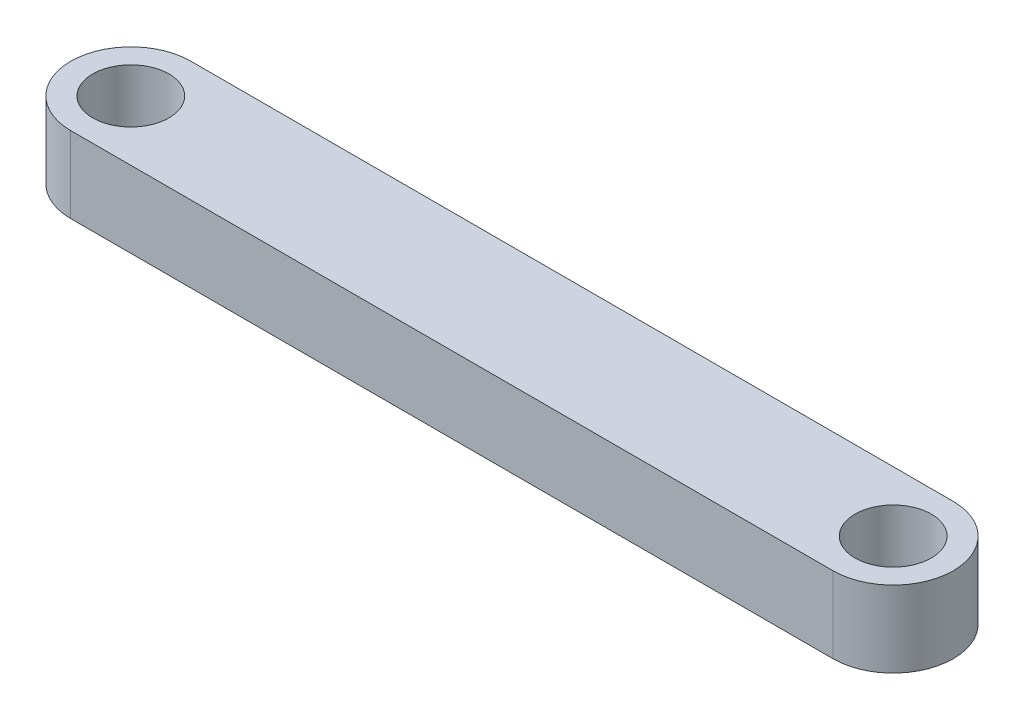
ISO-10303-21;
HEADER;
FILE_DESCRIPTION(('STEP AP214'),'2;1');
FILE_NAME('part.step','',(''),(''),'','','');
FILE_SCHEMA(('AUTOMOTIVE_DESIGN { 1 0 10303 214 1 1 1 1 }'));
ENDSEC;
DATA;
#1=APPLICATION_CONTEXT('core data for automotive mechanical design processes');
#2=APPLICATION_PROTOCOL_DEFINITION('international standard','automotive_design',2000,#1);
#3=PRODUCT_CONTEXT('',#1,'mechanical');
#4=PRODUCT('Part','Part','',(#3));
#5=PRODUCT_RELATED_PRODUCT_CATEGORY('part','',(#4));
#6=PRODUCT_DEFINITION_FORMATION('','',#4);
#7=PRODUCT_DEFINITION_CONTEXT('part definition',#1,'design');
#8=PRODUCT_DEFINITION('design','',#6,#7);
#9=PRODUCT_DEFINITION_SHAPE('','',#8);
#10=(LENGTH_UNIT() NAMED_UNIT(*) SI_UNIT(.MILLI.,.METRE.));
#11=(NAMED_UNIT(*) PLANE_ANGLE_UNIT() SI_UNIT($,.RADIAN.));
#12=(NAMED_UNIT(*) SI_UNIT($,.STERADIAN.) SOLID_ANGLE_UNIT());
#13=UNCERTAINTY_MEASURE_WITH_UNIT(LENGTH_MEASURE(1.E-05),#10,'distance_accuracy_value','');
#14=(GEOMETRIC_REPRESENTATION_CONTEXT(3) GLOBAL_UNCERTAINTY_ASSIGNED_CONTEXT((#13)) GLOBAL_UNIT_ASSIGNED_CONTEXT((#10,
#11,#12)) REPRESENTATION_CONTEXT('',''));
#15=CARTESIAN_POINT('',(0.,0.,0.));
#16=DIRECTION('',(0.,0.,1.));
#17=DIRECTION('',(1.,0.,0.));
#18=AXIS2_PLACEMENT_3D('',#15,#16,#17);
#19=CARTESIAN_POINT('',(15.,3.,0.));
#20=DIRECTION('',(0.,-1.,0.));
#21=DIRECTION('',(0.,0.,-1.));
#22=AXIS2_PLACEMENT_3D('',#19,#20,#21);
#23=CYLINDRICAL_SURFACE('',#22,2.36500190672861);
#24=CARTESIAN_POINT('',(15.,0.,0.));
#25=DIRECTION('',(0.,1.,0.));
#26=DIRECTION('',(0.,0.,1.));
#27=AXIS2_PLACEMENT_3D('',#24,#25,#26);
#28=CIRCLE('',#27,2.36500190672861);
#29=CARTESIAN_POINT('',(15.,0.,-2.36500190672861));
#30=VERTEX_POINT('',#29);
#31=CARTESIAN_POINT('',(15.,0.,2.36500190672861));
#32=VERTEX_POINT('',#31);
#33=EDGE_CURVE('E106',#30,#32,#28,.F.);
#34=ORIENTED_EDGE('',*,*,#33,.F.);
#35=DIRECTION('',(0.,-1.,0.));
#36=VECTOR('',#35,1.);
#37=CARTESIAN_POINT('',(15.,3.,-2.36500190672861));
#38=LINE('',#37,#36);
#39=CARTESIAN_POINT('',(15.,3.,-2.36500190672861));
#40=VERTEX_POINT('',#39);
#41=EDGE_CURVE('E11',#40,#30,#38,.T.);
#42=ORIENTED_EDGE('',*,*,#41,.F.);
#43=CARTESIAN_POINT('',(15.,3.,0.));
#44=DIRECTION('',(0.,1.,0.));
#45=DIRECTION('',(0.,0.,1.));
#46=AXIS2_PLACEMENT_3D('',#43,#44,#45);
#47=CIRCLE('',#46,2.36500190672861);
#48=CARTESIAN_POINT('',(15.,3.,2.36500190672861));
#49=VERTEX_POINT('',#48);
#50=EDGE_CURVE('E94',#40,#49,#47,.F.);
#51=ORIENTED_EDGE('',*,*,#50,.T.);
#52=DIRECTION('',(0.,-1.,0.));
#53=VECTOR('',#52,1.);
#54=CARTESIAN_POINT('',(15.,3.,2.36500190672861));
#55=LINE('',#54,#53);
#56=EDGE_CURVE('E74',#49,#32,#55,.T.);
#57=ORIENTED_EDGE('',*,*,#56,.T.);
#58=EDGE_LOOP('',(#34,#42,#51,#57));
#59=FACE_BOUND('',#58,.T.);
#60=ADVANCED_FACE('F36',(#59),#23,.T.);
#61=CARTESIAN_POINT('',(0.,3.,-2.36500190672861));
#62=DIRECTION('',(0.,0.,-1.));
#63=DIRECTION('',(-1.,0.,0.));
#64=AXIS2_PLACEMENT_3D('',#61,#62,#63);
#65=PLANE('',#64);
#66=DIRECTION('',(1.,0.,0.));
#67=VECTOR('',#66,1.);
#68=CARTESIAN_POINT('',(0.,0.,-2.36500190672861));
#69=LINE('',#68,#67);
#70=CARTESIAN_POINT('',(-15.,0.,-2.36500190672861));
#71=VERTEX_POINT('',#70);
#72=EDGE_CURVE('E87',#71,#30,#69,.T.);
#73=ORIENTED_EDGE('',*,*,#72,.F.);
#74=DIRECTION('',(0.,-1.,0.));
#75=VECTOR('',#74,1.);
#76=CARTESIAN_POINT('',(-15.,3.,-2.36500190672861));
#77=LINE('',#76,#75);
#78=CARTESIAN_POINT('',(-15.,3.,-2.36500190672861));
#79=VERTEX_POINT('',#78);
#80=EDGE_CURVE('E44',#79,#71,#77,.T.);
#81=ORIENTED_EDGE('',*,*,#80,.F.);
#82=DIRECTION('',(1.,0.,0.));
#83=VECTOR('',#82,1.);
#84=CARTESIAN_POINT('',(0.,3.,-2.36500190672861));
#85=LINE('',#84,#83);
#86=EDGE_CURVE('E85',#79,#40,#85,.T.);
#87=ORIENTED_EDGE('',*,*,#86,.T.);
#88=ORIENTED_EDGE('',*,*,#41,.T.);
#89=EDGE_LOOP('',(#73,#81,#87,#88));
#90=FACE_BOUND('',#89,.T.);
#91=ADVANCED_FACE('F83',(#90),#65,.T.);
#92=CARTESIAN_POINT('',(-15.,3.,0.));
#93=DIRECTION('',(0.,-1.,0.));
#94=DIRECTION('',(0.,0.,-1.));
#95=AXIS2_PLACEMENT_3D('',#92,#93,#94);
#96=CYLINDRICAL_SURFACE('',#95,2.36500190672861);
#97=CARTESIAN_POINT('',(-15.,0.,0.));
#98=DIRECTION('',(0.,1.,0.));
#99=DIRECTION('',(0.,0.,1.));
#100=AXIS2_PLACEMENT_3D('',#97,#98,#99);
#101=CIRCLE('',#100,2.36500190672861);
#102=CARTESIAN_POINT('',(-15.,0.,2.36500190672861));
#103=VERTEX_POINT('',#102);
#104=EDGE_CURVE('E67',#71,#103,#101,.T.);
#105=ORIENTED_EDGE('',*,*,#104,.T.);
#106=DIRECTION('',(0.,-1.,0.));
#107=VECTOR('',#106,1.);
#108=CARTESIAN_POINT('',(-15.,3.,2.36500190672861));
#109=LINE('',#108,#107);
#110=CARTESIAN_POINT('',(-15.,3.,2.36500190672861));
#111=VERTEX_POINT('',#110);
#112=EDGE_CURVE('E88',#111,#103,#109,.T.);
#113=ORIENTED_EDGE('',*,*,#112,.F.);
#114=CARTESIAN_POINT('',(-15.,3.,0.));
#115=DIRECTION('',(0.,1.,0.));
#116=DIRECTION('',(0.,0.,1.));
#117=AXIS2_PLACEMENT_3D('',#114,#115,#116);
#118=CIRCLE('',#117,2.36500190672861);
#119=EDGE_CURVE('E89',#79,#111,#118,.T.);
#120=ORIENTED_EDGE('',*,*,#119,.F.);
#121=ORIENTED_EDGE('',*,*,#80,.T.);
#122=EDGE_LOOP('',(#105,#113,#120,#121));
#123=FACE_BOUND('',#122,.T.);
#124=ADVANCED_FACE('F90',(#123),#96,.T.);
#125=CARTESIAN_POINT('',(-15.,3.,0.));
#126=DIRECTION('',(0.,-1.,0.));
#127=DIRECTION('',(0.,0.,-1.));
#128=AXIS2_PLACEMENT_3D('',#125,#126,#127);
#129=CYLINDRICAL_SURFACE('',#128,1.5);
#130=CARTESIAN_POINT('',(-15.,3.,0.));
#131=DIRECTION('',(0.,1.,0.));
#132=DIRECTION('',(0.,0.,1.));
#133=AXIS2_PLACEMENT_3D('',#130,#131,#132);
#134=CIRCLE('',#133,1.5);
#135=CARTESIAN_POINT('',(-15.,3.,1.5));
#136=VERTEX_POINT('',#135);
#137=EDGE_CURVE('E100',#136,#136,#134,.T.);
#138=ORIENTED_EDGE('',*,*,#137,.T.);
#139=EDGE_LOOP('',(#138));
#140=FACE_BOUND('',#139,.T.);
#141=CARTESIAN_POINT('',(-15.,0.,0.));
#142=DIRECTION('',(0.,1.,0.));
#143=DIRECTION('',(0.,0.,1.));
#144=AXIS2_PLACEMENT_3D('',#141,#142,#143);
#145=CIRCLE('',#144,1.5);
#146=CARTESIAN_POINT('',(-15.,0.,1.5));
#147=VERTEX_POINT('',#146);
#148=EDGE_CURVE('E113',#147,#147,#145,.T.);
#149=ORIENTED_EDGE('',*,*,#148,.F.);
#150=EDGE_LOOP('',(#149));
#151=FACE_BOUND('',#150,.T.);
#152=ADVANCED_FACE('F132',(#140,#151),#129,.F.);
#153=CARTESIAN_POINT('',(0.,3.,2.36500190672861));
#154=DIRECTION('',(0.,0.,-1.));
#155=DIRECTION('',(-1.,0.,0.));
#156=AXIS2_PLACEMENT_3D('',#153,#154,#155);
#157=PLANE('',#156);
#158=DIRECTION('',(1.,0.,0.));
#159=VECTOR('',#158,1.);
#160=CARTESIAN_POINT('',(0.,0.,2.36500190672861));
#161=LINE('',#160,#159);
#162=EDGE_CURVE('E111',#103,#32,#161,.T.);
#163=ORIENTED_EDGE('',*,*,#162,.T.);
#164=ORIENTED_EDGE('',*,*,#56,.F.);
#165=DIRECTION('',(1.,0.,0.));
#166=VECTOR('',#165,1.);
#167=CARTESIAN_POINT('',(0.,3.,2.36500190672861));
#168=LINE('',#167,#166);
#169=EDGE_CURVE('E52',#111,#49,#168,.T.);
#170=ORIENTED_EDGE('',*,*,#169,.F.);
#171=ORIENTED_EDGE('',*,*,#112,.T.);
#172=EDGE_LOOP('',(#163,#164,#170,#171));
#173=FACE_BOUND('',#172,.T.);
#174=ADVANCED_FACE('F121',(#173),#157,.F.);
#175=CARTESIAN_POINT('',(15.,3.,0.));
#176=DIRECTION('',(0.,-1.,0.));
#177=DIRECTION('',(0.,0.,-1.));
#178=AXIS2_PLACEMENT_3D('',#175,#176,#177);
#179=CYLINDRICAL_SURFACE('',#178,1.5);
#180=CARTESIAN_POINT('',(15.,3.,0.));
#181=DIRECTION('',(0.,1.,0.));
#182=DIRECTION('',(0.,0.,1.));
#183=AXIS2_PLACEMENT_3D('',#180,#181,#182);
#184=CIRCLE('',#183,1.5);
#185=CARTESIAN_POINT('',(15.,3.,1.5));
#186=VERTEX_POINT('',#185);
#187=EDGE_CURVE('E103',#186,#186,#184,.F.);
#188=ORIENTED_EDGE('',*,*,#187,.F.);
#189=EDGE_LOOP('',(#188));
#190=FACE_BOUND('',#189,.T.);
#191=CARTESIAN_POINT('',(15.,0.,0.));
#192=DIRECTION('',(0.,1.,0.));
#193=DIRECTION('',(0.,0.,1.));
#194=AXIS2_PLACEMENT_3D('',#191,#192,#193);
#195=CIRCLE('',#194,1.5);
#196=CARTESIAN_POINT('',(15.,0.,1.5));
#197=VERTEX_POINT('',#196);
#198=EDGE_CURVE('E96',#197,#197,#195,.F.);
#199=ORIENTED_EDGE('',*,*,#198,.T.);
#200=EDGE_LOOP('',(#199));
#201=FACE_BOUND('',#200,.T.);
#202=ADVANCED_FACE('F137',(#190,#201),#179,.F.);
#203=CARTESIAN_POINT('',(0.,3.,0.));
#204=DIRECTION('',(0.,1.,0.));
#205=DIRECTION('',(0.,0.,1.));
#206=AXIS2_PLACEMENT_3D('',#203,#204,#205);
#207=PLANE('',#206);
#208=ORIENTED_EDGE('',*,*,#50,.F.);
#209=ORIENTED_EDGE('',*,*,#86,.F.);
#210=ORIENTED_EDGE('',*,*,#119,.T.);
#211=ORIENTED_EDGE('',*,*,#169,.T.);
#212=EDGE_LOOP('',(#208,#209,#210,#211));
#213=FACE_BOUND('',#212,.T.);
#214=ORIENTED_EDGE('',*,*,#137,.F.);
#215=EDGE_LOOP('',(#214));
#216=FACE_BOUND('',#215,.T.);
#217=ORIENTED_EDGE('',*,*,#187,.T.);
#218=EDGE_LOOP('',(#217));
#219=FACE_BOUND('',#218,.T.);
#220=ADVANCED_FACE('F92',(#213,#216,#219),#207,.T.);
#221=CARTESIAN_POINT('',(0.,0.,0.));
#222=DIRECTION('',(0.,1.,0.));
#223=DIRECTION('',(0.,0.,1.));
#224=AXIS2_PLACEMENT_3D('',#221,#222,#223);
#225=PLANE('',#224);
#226=ORIENTED_EDGE('',*,*,#33,.T.);
#227=ORIENTED_EDGE('',*,*,#162,.F.);
#228=ORIENTED_EDGE('',*,*,#104,.F.);
#229=ORIENTED_EDGE('',*,*,#72,.T.);
#230=EDGE_LOOP('',(#226,#227,#228,#229));
#231=FACE_BOUND('',#230,.T.);
#232=ORIENTED_EDGE('',*,*,#148,.T.);
#233=EDGE_LOOP('',(#232));
#234=FACE_BOUND('',#233,.T.);
#235=ORIENTED_EDGE('',*,*,#198,.F.);
#236=EDGE_LOOP('',(#235));
#237=FACE_BOUND('',#236,.T.);
#238=ADVANCED_FACE('F123',(#231,#234,#237),#225,.F.);
#239=CLOSED_SHELL('',(#60,#91,#124,#152,#174,#202,#220,#238));
#240=MANIFOLD_SOLID_BREP('B2',#239);
#241=ADVANCED_BREP_SHAPE_REPRESENTATION('',(#18,#240),#14);
#242=SHAPE_DEFINITION_REPRESENTATION(#9,#241);
ENDSEC;
END-ISO-10303-21;
